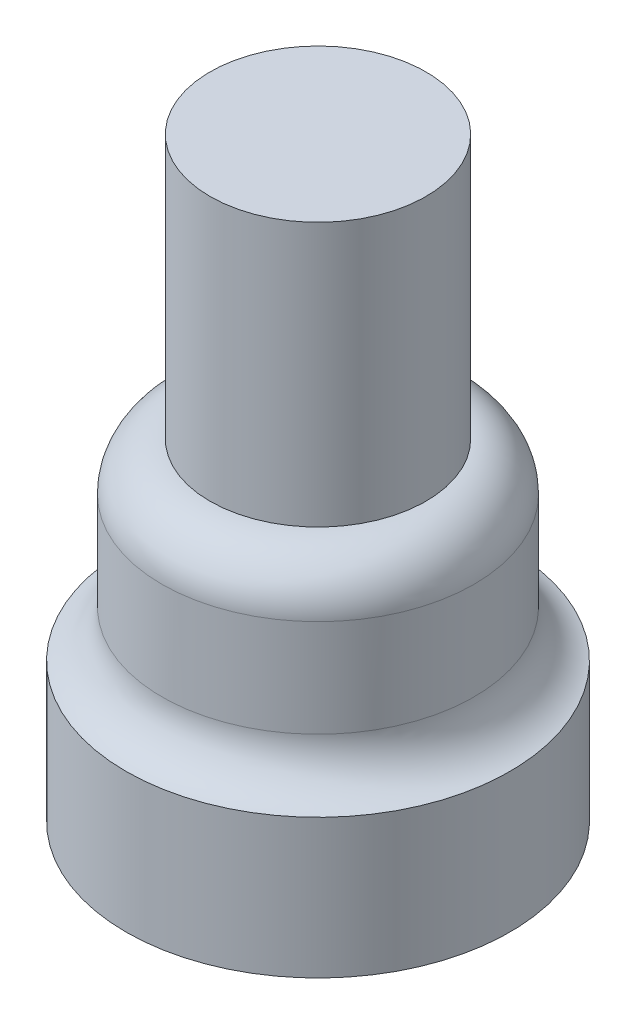
ISO-10303-21;
HEADER;
FILE_DESCRIPTION(('STEP AP214'),'2;1');
FILE_NAME('part.step','',(''),(''),'','','');
FILE_SCHEMA(('AUTOMOTIVE_DESIGN { 1 0 10303 214 1 1 1 1 }'));
ENDSEC;
DATA;
#1=APPLICATION_CONTEXT('core data for automotive mechanical design processes');
#2=APPLICATION_PROTOCOL_DEFINITION('international standard','automotive_design',2000,#1);
#3=PRODUCT_CONTEXT('',#1,'mechanical');
#4=PRODUCT('Part','Part','',(#3));
#5=PRODUCT_RELATED_PRODUCT_CATEGORY('part','',(#4));
#6=PRODUCT_DEFINITION_FORMATION('','',#4);
#7=PRODUCT_DEFINITION_CONTEXT('part definition',#1,'design');
#8=PRODUCT_DEFINITION('design','',#6,#7);
#9=PRODUCT_DEFINITION_SHAPE('','',#8);
#10=(LENGTH_UNIT() NAMED_UNIT(*) SI_UNIT(.MILLI.,.METRE.));
#11=(NAMED_UNIT(*) PLANE_ANGLE_UNIT() SI_UNIT($,.RADIAN.));
#12=(NAMED_UNIT(*) SI_UNIT($,.STERADIAN.) SOLID_ANGLE_UNIT());
#13=UNCERTAINTY_MEASURE_WITH_UNIT(LENGTH_MEASURE(1.E-05),#10,'distance_accuracy_value','');
#14=(GEOMETRIC_REPRESENTATION_CONTEXT(3) GLOBAL_UNCERTAINTY_ASSIGNED_CONTEXT((#13)) GLOBAL_UNIT_ASSIGNED_CONTEXT((#10,
#11,#12)) REPRESENTATION_CONTEXT('',''));
#15=CARTESIAN_POINT('',(0.,0.,0.));
#16=DIRECTION('',(0.,0.,1.));
#17=DIRECTION('',(1.,0.,0.));
#18=AXIS2_PLACEMENT_3D('',#15,#16,#17);
#19=CARTESIAN_POINT('',(0.,5.8,0.));
#20=DIRECTION('',(0.,-1.,0.));
#21=DIRECTION('',(0.,0.,-1.));
#22=AXIS2_PLACEMENT_3D('',#19,#20,#21);
#23=CYLINDRICAL_SURFACE('',#22,8.);
#24=CARTESIAN_POINT('',(0.,5.8,0.));
#25=DIRECTION('',(0.,1.,0.));
#26=DIRECTION('',(0.,0.,1.));
#27=AXIS2_PLACEMENT_3D('',#24,#25,#26);
#28=CIRCLE('',#27,8.);
#29=CARTESIAN_POINT('',(0.,5.8,8.));
#30=VERTEX_POINT('',#29);
#31=EDGE_CURVE('E49',#30,#30,#28,.T.);
#32=ORIENTED_EDGE('',*,*,#31,.F.);
#33=EDGE_LOOP('',(#32));
#34=FACE_BOUND('',#33,.T.);
#35=CARTESIAN_POINT('',(0.,0.,0.));
#36=DIRECTION('',(0.,1.,0.));
#37=DIRECTION('',(0.,0.,1.));
#38=AXIS2_PLACEMENT_3D('',#35,#36,#37);
#39=CIRCLE('',#38,8.);
#40=CARTESIAN_POINT('',(0.,0.,8.));
#41=VERTEX_POINT('',#40);
#42=EDGE_CURVE('E53',#41,#41,#39,.T.);
#43=ORIENTED_EDGE('',*,*,#42,.T.);
#44=EDGE_LOOP('',(#43));
#45=FACE_BOUND('',#44,.T.);
#46=ADVANCED_FACE('F37',(#34,#45),#23,.T.);
#47=CARTESIAN_POINT('',(0.,0.,0.));
#48=DIRECTION('',(0.,1.,0.));
#49=DIRECTION('',(0.,0.,1.));
#50=AXIS2_PLACEMENT_3D('',#47,#48,#49);
#51=PLANE('',#50);
#52=CARTESIAN_POINT('',(0.,0.,0.));
#53=DIRECTION('',(0.,-1.,0.));
#54=DIRECTION('',(0.,0.,-1.));
#55=AXIS2_PLACEMENT_3D('',#52,#53,#54);
#56=CIRCLE('',#55,6.);
#57=CARTESIAN_POINT('',(0.,0.,-6.));
#58=VERTEX_POINT('',#57);
#59=EDGE_CURVE('E59',#58,#58,#56,.T.);
#60=ORIENTED_EDGE('',*,*,#59,.F.);
#61=EDGE_LOOP('',(#60));
#62=FACE_BOUND('',#61,.T.);
#63=ORIENTED_EDGE('',*,*,#42,.F.);
#64=EDGE_LOOP('',(#63));
#65=FACE_BOUND('',#64,.T.);
#66=ADVANCED_FACE('F94',(#62,#65),#51,.F.);
#67=CARTESIAN_POINT('',(0.,13.8,0.));
#68=DIRECTION('',(0.,-1.,0.));
#69=DIRECTION('',(0.,0.,-1.));
#70=AXIS2_PLACEMENT_3D('',#67,#68,#69);
#71=CYLINDRICAL_SURFACE('',#70,6.5);
#72=CARTESIAN_POINT('',(0.,7.73649167310371,0.));
#73=DIRECTION('',(0.,-1.,0.));
#74=DIRECTION('',(0.,0.,-1.));
#75=AXIS2_PLACEMENT_3D('',#72,#73,#74);
#76=CIRCLE('',#75,6.5);
#77=CARTESIAN_POINT('',(0.,7.73649167310371,-6.5));
#78=VERTEX_POINT('',#77);
#79=EDGE_CURVE('E10',#78,#78,#76,.F.);
#80=ORIENTED_EDGE('',*,*,#79,.T.);
#81=EDGE_LOOP('',(#80));
#82=FACE_BOUND('',#81,.T.);
#83=CARTESIAN_POINT('',(0.,11.8,0.));
#84=DIRECTION('',(0.,1.,0.));
#85=DIRECTION('',(0.,0.,1.));
#86=AXIS2_PLACEMENT_3D('',#83,#84,#85);
#87=CIRCLE('',#86,6.5);
#88=CARTESIAN_POINT('',(0.,11.8,6.5));
#89=VERTEX_POINT('',#88);
#90=EDGE_CURVE('E45',#89,#89,#87,.F.);
#91=ORIENTED_EDGE('',*,*,#90,.T.);
#92=EDGE_LOOP('',(#91));
#93=FACE_BOUND('',#92,.T.);
#94=ADVANCED_FACE('F100',(#82,#93),#71,.T.);
#95=CARTESIAN_POINT('',(0.,5.8,0.));
#96=DIRECTION('',(0.,-1.,0.));
#97=DIRECTION('',(0.,0.,-1.));
#98=AXIS2_PLACEMENT_3D('',#95,#96,#97);
#99=CYLINDRICAL_SURFACE('',#98,6.);
#100=CARTESIAN_POINT('',(0.,5.8,0.));
#101=DIRECTION('',(0.,-1.,0.));
#102=DIRECTION('',(0.,0.,-1.));
#103=AXIS2_PLACEMENT_3D('',#100,#101,#102);
#104=CIRCLE('',#103,6.);
#105=CARTESIAN_POINT('',(0.,5.8,-6.));
#106=VERTEX_POINT('',#105);
#107=EDGE_CURVE('E57',#106,#106,#104,.T.);
#108=ORIENTED_EDGE('',*,*,#107,.F.);
#109=EDGE_LOOP('',(#108));
#110=FACE_BOUND('',#109,.T.);
#111=ORIENTED_EDGE('',*,*,#59,.T.);
#112=EDGE_LOOP('',(#111));
#113=FACE_BOUND('',#112,.T.);
#114=ADVANCED_FACE('F123',(#110,#113),#99,.F.);
#115=CARTESIAN_POINT('',(0.,5.8,0.));
#116=DIRECTION('',(0.,-1.,0.));
#117=DIRECTION('',(0.,0.,-1.));
#118=AXIS2_PLACEMENT_3D('',#115,#116,#117);
#119=PLANE('',#118);
#120=CARTESIAN_POINT('',(0.,5.8,0.));
#121=DIRECTION('',(0.,-1.,0.));
#122=DIRECTION('',(0.,0.,-1.));
#123=AXIS2_PLACEMENT_3D('',#120,#121,#122);
#124=CIRCLE('',#123,4.5);
#125=CARTESIAN_POINT('',(0.,5.8,-4.5));
#126=VERTEX_POINT('',#125);
#127=EDGE_CURVE('E65',#126,#126,#124,.T.);
#128=ORIENTED_EDGE('',*,*,#127,.F.);
#129=EDGE_LOOP('',(#128));
#130=FACE_BOUND('',#129,.T.);
#131=ORIENTED_EDGE('',*,*,#107,.T.);
#132=EDGE_LOOP('',(#131));
#133=FACE_BOUND('',#132,.T.);
#134=ADVANCED_FACE('F120',(#130,#133),#119,.T.);
#135=CARTESIAN_POINT('',(0.,12.8,0.));
#136=DIRECTION('',(0.,-1.,0.));
#137=DIRECTION('',(0.,0.,-1.));
#138=AXIS2_PLACEMENT_3D('',#135,#136,#137);
#139=CYLINDRICAL_SURFACE('',#138,4.5);
#140=CARTESIAN_POINT('',(0.,12.8,0.));
#141=DIRECTION('',(0.,-1.,0.));
#142=DIRECTION('',(0.,0.,-1.));
#143=AXIS2_PLACEMENT_3D('',#140,#141,#142);
#144=CIRCLE('',#143,4.5);
#145=CARTESIAN_POINT('',(0.,12.8,-4.5));
#146=VERTEX_POINT('',#145);
#147=EDGE_CURVE('E62',#146,#146,#144,.T.);
#148=ORIENTED_EDGE('',*,*,#147,.F.);
#149=EDGE_LOOP('',(#148));
#150=FACE_BOUND('',#149,.T.);
#151=ORIENTED_EDGE('',*,*,#127,.T.);
#152=EDGE_LOOP('',(#151));
#153=FACE_BOUND('',#152,.T.);
#154=ADVANCED_FACE('F117',(#150,#153),#139,.F.);
#155=CARTESIAN_POINT('',(0.,12.8,0.));
#156=DIRECTION('',(0.,-1.,0.));
#157=DIRECTION('',(0.,0.,-1.));
#158=AXIS2_PLACEMENT_3D('',#155,#156,#157);
#159=PLANE('',#158);
#160=ORIENTED_EDGE('',*,*,#147,.T.);
#161=EDGE_LOOP('',(#160));
#162=FACE_BOUND('',#161,.T.);
#163=ADVANCED_FACE('F82',(#162),#159,.T.);
#164=CARTESIAN_POINT('',(0.,24.8,0.));
#165=DIRECTION('',(0.,-1.,0.));
#166=DIRECTION('',(0.,0.,-1.));
#167=AXIS2_PLACEMENT_3D('',#164,#165,#166);
#168=CYLINDRICAL_SURFACE('',#167,4.5);
#169=CARTESIAN_POINT('',(0.,24.8,0.));
#170=DIRECTION('',(0.,1.,0.));
#171=DIRECTION('',(0.,0.,1.));
#172=AXIS2_PLACEMENT_3D('',#169,#170,#171);
#173=CIRCLE('',#172,4.5);
#174=CARTESIAN_POINT('',(0.,24.8,4.5));
#175=VERTEX_POINT('',#174);
#176=EDGE_CURVE('E68',#175,#175,#173,.T.);
#177=ORIENTED_EDGE('',*,*,#176,.F.);
#178=EDGE_LOOP('',(#177));
#179=FACE_BOUND('',#178,.T.);
#180=CARTESIAN_POINT('',(0.,13.8,0.));
#181=DIRECTION('',(0.,1.,0.));
#182=DIRECTION('',(0.,0.,1.));
#183=AXIS2_PLACEMENT_3D('',#180,#181,#182);
#184=CIRCLE('',#183,4.5);
#185=CARTESIAN_POINT('',(0.,13.8,4.5));
#186=VERTEX_POINT('',#185);
#187=EDGE_CURVE('E71',#186,#186,#184,.T.);
#188=ORIENTED_EDGE('',*,*,#187,.T.);
#189=EDGE_LOOP('',(#188));
#190=FACE_BOUND('',#189,.T.);
#191=ADVANCED_FACE('F79',(#179,#190),#168,.T.);
#192=CARTESIAN_POINT('',(0.,24.8,0.));
#193=DIRECTION('',(0.,1.,0.));
#194=DIRECTION('',(0.,0.,1.));
#195=AXIS2_PLACEMENT_3D('',#192,#193,#194);
#196=PLANE('',#195);
#197=ORIENTED_EDGE('',*,*,#176,.T.);
#198=EDGE_LOOP('',(#197));
#199=FACE_BOUND('',#198,.T.);
#200=ADVANCED_FACE('F77',(#199),#196,.T.);
#201=CARTESIAN_POINT('',(0.,7.73649167310371,0.));
#202=DIRECTION('',(0.,-1.,0.));
#203=DIRECTION('',(0.,0.,-1.));
#204=AXIS2_PLACEMENT_3D('',#201,#202,#203);
#205=TOROIDAL_SURFACE('',#204,8.5,2.);
#206=ORIENTED_EDGE('',*,*,#31,.T.);
#207=EDGE_LOOP('',(#206));
#208=FACE_BOUND('',#207,.T.);
#209=ORIENTED_EDGE('',*,*,#79,.F.);
#210=EDGE_LOOP('',(#209));
#211=FACE_BOUND('',#210,.T.);
#212=ADVANCED_FACE('F87',(#208,#211),#205,.F.);
#213=CARTESIAN_POINT('',(0.,11.8,0.));
#214=DIRECTION('',(0.,1.,0.));
#215=DIRECTION('',(0.,0.,1.));
#216=AXIS2_PLACEMENT_3D('',#213,#214,#215);
#217=TOROIDAL_SURFACE('',#216,4.5,2.);
#218=ORIENTED_EDGE('',*,*,#90,.F.);
#219=EDGE_LOOP('',(#218));
#220=FACE_BOUND('',#219,.T.);
#221=ORIENTED_EDGE('',*,*,#187,.F.);
#222=EDGE_LOOP('',(#221));
#223=FACE_BOUND('',#222,.T.);
#224=ADVANCED_FACE('F40',(#220,#223),#217,.T.);
#225=CLOSED_SHELL('',(#46,#66,#94,#114,#134,#154,#163,#191,#200,#212,#224));
#226=MANIFOLD_SOLID_BREP('B2',#225);
#227=ADVANCED_BREP_SHAPE_REPRESENTATION('',(#18,#226),#14);
#228=SHAPE_DEFINITION_REPRESENTATION(#9,#227);
ENDSEC;
END-ISO-10303-21;
